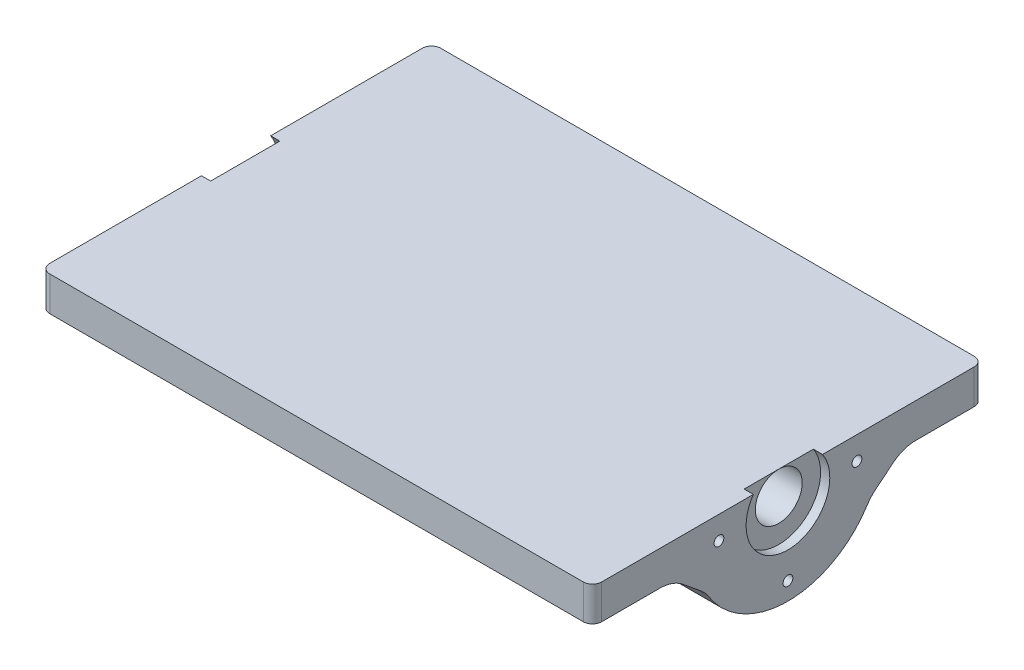
ISO-10303-21;
HEADER;
FILE_DESCRIPTION(('STEP AP214'),'2;1');
FILE_NAME('part.step','',(''),(''),'','','');
FILE_SCHEMA(('AUTOMOTIVE_DESIGN { 1 0 10303 214 1 1 1 1 }'));
ENDSEC;
DATA;
#1=APPLICATION_CONTEXT('core data for automotive mechanical design processes');
#2=APPLICATION_PROTOCOL_DEFINITION('international standard','automotive_design',2000,#1);
#3=PRODUCT_CONTEXT('',#1,'mechanical');
#4=PRODUCT('Part','Part','',(#3));
#5=PRODUCT_RELATED_PRODUCT_CATEGORY('part','',(#4));
#6=PRODUCT_DEFINITION_FORMATION('','',#4);
#7=PRODUCT_DEFINITION_CONTEXT('part definition',#1,'design');
#8=PRODUCT_DEFINITION('design','',#6,#7);
#9=PRODUCT_DEFINITION_SHAPE('','',#8);
#10=(LENGTH_UNIT() NAMED_UNIT(*) SI_UNIT(.MILLI.,.METRE.));
#11=(NAMED_UNIT(*) PLANE_ANGLE_UNIT() SI_UNIT($,.RADIAN.));
#12=(NAMED_UNIT(*) SI_UNIT($,.STERADIAN.) SOLID_ANGLE_UNIT());
#13=UNCERTAINTY_MEASURE_WITH_UNIT(LENGTH_MEASURE(1.E-05),#10,'distance_accuracy_value','');
#14=(GEOMETRIC_REPRESENTATION_CONTEXT(3) GLOBAL_UNCERTAINTY_ASSIGNED_CONTEXT((#13)) GLOBAL_UNIT_ASSIGNED_CONTEXT((#10,
#11,#12)) REPRESENTATION_CONTEXT('',''));
#15=CARTESIAN_POINT('',(0.,0.,0.));
#16=DIRECTION('',(0.,0.,1.));
#17=DIRECTION('',(1.,0.,0.));
#18=AXIS2_PLACEMENT_3D('',#15,#16,#17);
#19=CARTESIAN_POINT('',(-154.686,-6.50240000000002,53.975));
#20=DIRECTION('',(1.,0.,0.));
#21=DIRECTION('',(0.,1.,0.));
#22=AXIS2_PLACEMENT_3D('',#19,#20,#21);
#23=CYLINDRICAL_SURFACE('',#22,6.477);
#24=CARTESIAN_POINT('',(-2.53999999999999,-6.5024,53.975));
#25=DIRECTION('',(1.,0.,0.));
#26=DIRECTION('',(0.,1.,0.));
#27=AXIS2_PLACEMENT_3D('',#24,#25,#26);
#28=CIRCLE('',#27,6.477);
#29=CARTESIAN_POINT('',(-2.53999999999999,-0.0254000000000061,53.975));
#30=VERTEX_POINT('',#29);
#31=EDGE_CURVE('E325',#30,#30,#28,.F.);
#32=ORIENTED_EDGE('',*,*,#31,.F.);
#33=EDGE_LOOP('',(#32));
#34=FACE_BOUND('',#33,.T.);
#35=CARTESIAN_POINT('',(-149.86,-6.50240000000002,53.975));
#36=DIRECTION('',(-1.,0.,0.));
#37=DIRECTION('',(0.,0.,1.));
#38=AXIS2_PLACEMENT_3D('',#35,#36,#37);
#39=CIRCLE('',#38,6.477);
#40=CARTESIAN_POINT('',(-149.86,-6.50240000000002,60.452));
#41=VERTEX_POINT('',#40);
#42=EDGE_CURVE('E191',#41,#41,#39,.F.);
#43=ORIENTED_EDGE('',*,*,#42,.F.);
#44=EDGE_LOOP('',(#43));
#45=FACE_BOUND('',#44,.T.);
#46=ADVANCED_FACE('F44',(#34,#45),#23,.F.);
#47=CARTESIAN_POINT('',(0.,0.,107.95));
#48=DIRECTION('',(0.,-1.,0.));
#49=DIRECTION('',(1.,0.,0.));
#50=AXIS2_PLACEMENT_3D('',#47,#48,#49);
#51=PLANE('',#50);
#52=DIRECTION('',(-1.,0.,0.));
#53=VECTOR('',#52,1.);
#54=CARTESIAN_POINT('',(0.,0.,107.95));
#55=LINE('',#54,#53);
#56=CARTESIAN_POINT('',(-2.54,0.,107.95));
#57=VERTEX_POINT('',#56);
#58=CARTESIAN_POINT('',(-149.86,0.,107.95));
#59=VERTEX_POINT('',#58);
#60=EDGE_CURVE('E310',#57,#59,#55,.T.);
#61=ORIENTED_EDGE('',*,*,#60,.F.);
#62=CARTESIAN_POINT('',(-2.54,0.,105.41));
#63=DIRECTION('',(0.,-1.,0.));
#64=DIRECTION('',(1.,0.,0.));
#65=AXIS2_PLACEMENT_3D('',#62,#63,#64);
#66=CIRCLE('',#65,2.54);
#67=CARTESIAN_POINT('',(0.,0.,105.41));
#68=VERTEX_POINT('',#67);
#69=EDGE_CURVE('E270',#57,#68,#66,.F.);
#70=ORIENTED_EDGE('',*,*,#69,.T.);
#71=DIRECTION('',(0.,0.,-1.));
#72=VECTOR('',#71,1.);
#73=CARTESIAN_POINT('',(0.,0.,107.95));
#74=LINE('',#73,#72);
#75=CARTESIAN_POINT('',(0.,0.,63.5292159929531));
#76=VERTEX_POINT('',#75);
#77=EDGE_CURVE('E323',#68,#76,#74,.T.);
#78=ORIENTED_EDGE('',*,*,#77,.T.);
#79=DIRECTION('',(1.,0.,0.));
#80=VECTOR('',#79,1.);
#81=CARTESIAN_POINT('',(-2.54,0.,63.5292159929531));
#82=LINE('',#81,#80);
#83=CARTESIAN_POINT('',(-2.54,0.,63.5292159929531));
#84=VERTEX_POINT('',#83);
#85=EDGE_CURVE('E209',#76,#84,#82,.F.);
#86=ORIENTED_EDGE('',*,*,#85,.T.);
#87=DIRECTION('',(0.,0.,1.));
#88=VECTOR('',#87,1.);
#89=CARTESIAN_POINT('',(-2.54,0.,107.95));
#90=LINE('',#89,#88);
#91=CARTESIAN_POINT('',(-2.54,0.,44.4207840070469));
#92=VERTEX_POINT('',#91);
#93=EDGE_CURVE('E327',#92,#84,#90,.T.);
#94=ORIENTED_EDGE('',*,*,#93,.F.);
#95=DIRECTION('',(1.,0.,0.));
#96=VECTOR('',#95,1.);
#97=CARTESIAN_POINT('',(-2.54,0.,44.4207840070469));
#98=LINE('',#97,#96);
#99=CARTESIAN_POINT('',(0.,0.,44.4207840070469));
#100=VERTEX_POINT('',#99);
#101=EDGE_CURVE('E203',#92,#100,#98,.T.);
#102=ORIENTED_EDGE('',*,*,#101,.T.);
#103=CARTESIAN_POINT('',(0.,0.,2.54));
#104=VERTEX_POINT('',#103);
#105=EDGE_CURVE('E307',#100,#104,#74,.T.);
#106=ORIENTED_EDGE('',*,*,#105,.T.);
#107=CARTESIAN_POINT('',(-2.54,0.,2.54));
#108=DIRECTION('',(0.,-1.,0.));
#109=DIRECTION('',(1.,0.,0.));
#110=AXIS2_PLACEMENT_3D('',#107,#108,#109);
#111=CIRCLE('',#110,2.54);
#112=CARTESIAN_POINT('',(-2.54,0.,0.));
#113=VERTEX_POINT('',#112);
#114=EDGE_CURVE('E264',#104,#113,#111,.F.);
#115=ORIENTED_EDGE('',*,*,#114,.T.);
#116=DIRECTION('',(-1.,0.,0.));
#117=VECTOR('',#116,1.);
#118=CARTESIAN_POINT('',(0.,0.,0.));
#119=LINE('',#118,#117);
#120=CARTESIAN_POINT('',(-149.86,0.,0.));
#121=VERTEX_POINT('',#120);
#122=EDGE_CURVE('E305',#113,#121,#119,.T.);
#123=ORIENTED_EDGE('',*,*,#122,.T.);
#124=CARTESIAN_POINT('',(-149.86,0.,2.54));
#125=DIRECTION('',(0.,-1.,0.));
#126=DIRECTION('',(1.,0.,0.));
#127=AXIS2_PLACEMENT_3D('',#124,#125,#126);
#128=CIRCLE('',#127,2.54);
#129=CARTESIAN_POINT('',(-152.4,0.,2.54));
#130=VERTEX_POINT('',#129);
#131=EDGE_CURVE('E266',#121,#130,#128,.F.);
#132=ORIENTED_EDGE('',*,*,#131,.T.);
#133=DIRECTION('',(0.,0.,-1.));
#134=VECTOR('',#133,1.);
#135=CARTESIAN_POINT('',(-152.4,0.,107.95));
#136=LINE('',#135,#134);
#137=CARTESIAN_POINT('',(-152.4,0.,44.4207840070469));
#138=VERTEX_POINT('',#137);
#139=EDGE_CURVE('E314',#138,#130,#136,.T.);
#140=ORIENTED_EDGE('',*,*,#139,.F.);
#141=DIRECTION('',(-1.,0.,0.));
#142=VECTOR('',#141,1.);
#143=CARTESIAN_POINT('',(-149.86,0.,44.4207840070469));
#144=LINE('',#143,#142);
#145=CARTESIAN_POINT('',(-149.86,0.,44.4207840070469));
#146=VERTEX_POINT('',#145);
#147=EDGE_CURVE('E192',#146,#138,#144,.T.);
#148=ORIENTED_EDGE('',*,*,#147,.F.);
#149=DIRECTION('',(0.,0.,-1.));
#150=VECTOR('',#149,1.);
#151=CARTESIAN_POINT('',(-149.86,0.,107.95));
#152=LINE('',#151,#150);
#153=CARTESIAN_POINT('',(-149.86,0.,63.5292159929531));
#154=VERTEX_POINT('',#153);
#155=EDGE_CURVE('E197',#154,#146,#152,.T.);
#156=ORIENTED_EDGE('',*,*,#155,.F.);
#157=DIRECTION('',(-1.,0.,0.));
#158=VECTOR('',#157,1.);
#159=CARTESIAN_POINT('',(-149.86,0.,63.5292159929531));
#160=LINE('',#159,#158);
#161=CARTESIAN_POINT('',(-152.4,0.,63.5292159929531));
#162=VERTEX_POINT('',#161);
#163=EDGE_CURVE('E181',#162,#154,#160,.F.);
#164=ORIENTED_EDGE('',*,*,#163,.F.);
#165=CARTESIAN_POINT('',(-152.4,0.,105.41));
#166=VERTEX_POINT('',#165);
#167=EDGE_CURVE('E321',#166,#162,#136,.T.);
#168=ORIENTED_EDGE('',*,*,#167,.F.);
#169=CARTESIAN_POINT('',(-149.86,0.,105.41));
#170=DIRECTION('',(0.,-1.,0.));
#171=DIRECTION('',(1.,0.,0.));
#172=AXIS2_PLACEMENT_3D('',#169,#170,#171);
#173=CIRCLE('',#172,2.54);
#174=EDGE_CURVE('E268',#166,#59,#173,.F.);
#175=ORIENTED_EDGE('',*,*,#174,.T.);
#176=EDGE_LOOP('',(#61,#70,#78,#86,#94,#102,#106,#115,#123,#132,#140,#148,#156,#164,#168,#175));
#177=FACE_BOUND('',#176,.T.);
#178=ADVANCED_FACE('F200',(#177),#51,.F.);
#179=CARTESIAN_POINT('',(0.,0.,107.95));
#180=DIRECTION('',(-1.,0.,0.));
#181=DIRECTION('',(0.,-1.,0.));
#182=AXIS2_PLACEMENT_3D('',#179,#180,#181);
#183=PLANE('',#182);
#184=CARTESIAN_POINT('',(0.,-6.35,73.025));
#185=DIRECTION('',(1.,0.,0.));
#186=DIRECTION('',(0.,1.,0.));
#187=AXIS2_PLACEMENT_3D('',#184,#185,#186);
#188=CIRCLE('',#187,1.35255);
#189=CARTESIAN_POINT('',(0.,-4.99745,73.025));
#190=VERTEX_POINT('',#189);
#191=EDGE_CURVE('E317',#190,#190,#188,.T.);
#192=ORIENTED_EDGE('',*,*,#191,.F.);
#193=EDGE_LOOP('',(#192));
#194=FACE_BOUND('',#193,.T.);
#195=CARTESIAN_POINT('',(0.,-6.35,34.925));
#196=DIRECTION('',(1.,0.,0.));
#197=DIRECTION('',(0.,1.,0.));
#198=AXIS2_PLACEMENT_3D('',#195,#196,#197);
#199=CIRCLE('',#198,1.35255);
#200=CARTESIAN_POINT('',(0.,-4.99745,34.925));
#201=VERTEX_POINT('',#200);
#202=EDGE_CURVE('E348',#201,#201,#199,.T.);
#203=ORIENTED_EDGE('',*,*,#202,.F.);
#204=EDGE_LOOP('',(#203));
#205=FACE_BOUND('',#204,.T.);
#206=CARTESIAN_POINT('',(0.,-25.4,53.975));
#207=DIRECTION('',(1.,0.,0.));
#208=DIRECTION('',(0.,1.,0.));
#209=AXIS2_PLACEMENT_3D('',#206,#207,#208);
#210=CIRCLE('',#209,1.35255);
#211=CARTESIAN_POINT('',(0.,-24.04745,53.975));
#212=VERTEX_POINT('',#211);
#213=EDGE_CURVE('E354',#212,#212,#210,.T.);
#214=ORIENTED_EDGE('',*,*,#213,.F.);
#215=EDGE_LOOP('',(#214));
#216=FACE_BOUND('',#215,.T.);
#217=ORIENTED_EDGE('',*,*,#77,.F.);
#218=DIRECTION('',(0.,1.,0.));
#219=VECTOR('',#218,1.);
#220=CARTESIAN_POINT('',(0.,0.,105.41));
#221=LINE('',#220,#219);
#222=CARTESIAN_POINT('',(0.,-9.525,105.41));
#223=VERTEX_POINT('',#222);
#224=EDGE_CURVE('E275',#68,#223,#221,.F.);
#225=ORIENTED_EDGE('',*,*,#224,.T.);
#226=DIRECTION('',(0.,0.,1.));
#227=VECTOR('',#226,1.);
#228=CARTESIAN_POINT('',(0.,-9.525,107.95));
#229=LINE('',#228,#227);
#230=CARTESIAN_POINT('',(0.,-9.525,89.2974040542828));
#231=VERTEX_POINT('',#230);
#232=EDGE_CURVE('E466',#231,#223,#229,.T.);
#233=ORIENTED_EDGE('',*,*,#232,.F.);
#234=CARTESIAN_POINT('',(0.,-19.525,89.2974040542828));
#235=DIRECTION('',(-1.,0.,0.));
#236=DIRECTION('',(0.,-1.,0.));
#237=AXIS2_PLACEMENT_3D('',#234,#235,#236);
#238=CIRCLE('',#237,10.);
#239=CARTESIAN_POINT('',(0.,-11.7885396183789,82.9612237566897));
#240=VERTEX_POINT('',#239);
#241=EDGE_CURVE('E241',#231,#240,#238,.T.);
#242=ORIENTED_EDGE('',*,*,#241,.T.);
#243=DIRECTION('',(0.,-0.633618029759309,-0.773646038162112));
#244=VECTOR('',#243,1.);
#245=CARTESIAN_POINT('',(0.,5.19362681087083,103.696406722347));
#246=LINE('',#245,#244);
#247=CARTESIAN_POINT('',(0.,-15.8476535429056,78.0050557522034));
#248=VERTEX_POINT('',#247);
#249=EDGE_CURVE('E202',#240,#248,#246,.T.);
#250=ORIENTED_EDGE('',*,*,#249,.T.);
#251=CARTESIAN_POINT('',(0.,-23.5841139245267,84.3412360497965));
#252=DIRECTION('',(-1.,0.,0.));
#253=DIRECTION('',(0.,-1.,0.));
#254=AXIS2_PLACEMENT_3D('',#251,#252,#253);
#255=CIRCLE('',#254,10.);
#256=CARTESIAN_POINT('',(0.,-18.2470161357175,75.8845589723217));
#257=VERTEX_POINT('',#256);
#258=EDGE_CURVE('E247',#248,#257,#255,.T.);
#259=ORIENTED_EDGE('',*,*,#258,.T.);
#260=CARTESIAN_POINT('',(0.,-4.41966318447054,53.975));
#261=DIRECTION('',(-1.,0.,0.));
#262=DIRECTION('',(0.,1.,0.));
#263=AXIS2_PLACEMENT_3D('',#260,#261,#262);
#264=CIRCLE('',#263,25.908);
#265=CARTESIAN_POINT('',(0.,-18.2470161357175,32.0654410276783));
#266=VERTEX_POINT('',#265);
#267=EDGE_CURVE('E302',#266,#257,#264,.T.);
#268=ORIENTED_EDGE('',*,*,#267,.F.);
#269=CARTESIAN_POINT('',(0.,-23.5841139245268,23.6087639502035));
#270=DIRECTION('',(-1.,0.,0.));
#271=DIRECTION('',(0.,-1.,0.));
#272=AXIS2_PLACEMENT_3D('',#269,#270,#271);
#273=CIRCLE('',#272,10.);
#274=CARTESIAN_POINT('',(0.,-15.8476535429057,29.9449442477966));
#275=VERTEX_POINT('',#274);
#276=EDGE_CURVE('E249',#266,#275,#273,.T.);
#277=ORIENTED_EDGE('',*,*,#276,.T.);
#278=DIRECTION('',(0.,0.633618029759308,-0.773646038162112));
#279=VECTOR('',#278,1.);
#280=CARTESIAN_POINT('',(0.,-47.7230398557958,68.8647116433393));
#281=LINE('',#280,#279);
#282=CARTESIAN_POINT('',(0.,-11.7885396183789,24.9887762433102));
#283=VERTEX_POINT('',#282);
#284=EDGE_CURVE('E215',#275,#283,#281,.T.);
#285=ORIENTED_EDGE('',*,*,#284,.T.);
#286=CARTESIAN_POINT('',(0.,-19.525,18.6525959457171));
#287=DIRECTION('',(-1.,0.,0.));
#288=DIRECTION('',(0.,-1.,0.));
#289=AXIS2_PLACEMENT_3D('',#286,#287,#288);
#290=CIRCLE('',#289,10.);
#291=CARTESIAN_POINT('',(0.,-9.525,18.6525959457171));
#292=VERTEX_POINT('',#291);
#293=EDGE_CURVE('E255',#283,#292,#290,.T.);
#294=ORIENTED_EDGE('',*,*,#293,.T.);
#295=DIRECTION('',(0.,0.,1.));
#296=VECTOR('',#295,1.);
#297=CARTESIAN_POINT('',(0.,-9.525,28.575));
#298=LINE('',#297,#296);
#299=CARTESIAN_POINT('',(0.,-9.525,2.54));
#300=VERTEX_POINT('',#299);
#301=EDGE_CURVE('E291',#300,#292,#298,.T.);
#302=ORIENTED_EDGE('',*,*,#301,.F.);
#303=DIRECTION('',(0.,1.,0.));
#304=VECTOR('',#303,1.);
#305=CARTESIAN_POINT('',(0.,0.,2.54));
#306=LINE('',#305,#304);
#307=EDGE_CURVE('E272',#300,#104,#306,.T.);
#308=ORIENTED_EDGE('',*,*,#307,.T.);
#309=ORIENTED_EDGE('',*,*,#105,.F.);
#310=CARTESIAN_POINT('',(0.,-6.5024,53.975));
#311=DIRECTION('',(1.,0.,0.));
#312=DIRECTION('',(0.,1.,0.));
#313=AXIS2_PLACEMENT_3D('',#310,#311,#312);
#314=CIRCLE('',#313,11.557);
#315=EDGE_CURVE('E337',#76,#100,#314,.T.);
#316=ORIENTED_EDGE('',*,*,#315,.F.);
#317=EDGE_LOOP('',(#217,#225,#233,#242,#250,#259,#268,#277,#285,#294,#302,#308,#309,#316));
#318=FACE_BOUND('',#317,.T.);
#319=ADVANCED_FACE('F297',(#194,#205,#216,#318),#183,.F.);
#320=CARTESIAN_POINT('',(-152.4,0.,107.95));
#321=DIRECTION('',(1.,0.,0.));
#322=DIRECTION('',(0.,0.,-1.));
#323=AXIS2_PLACEMENT_3D('',#320,#321,#322);
#324=PLANE('',#323);
#325=DIRECTION('',(0.,0.,1.));
#326=VECTOR('',#325,1.);
#327=CARTESIAN_POINT('',(-152.4,-9.52500000000002,107.95));
#328=LINE('',#327,#326);
#329=CARTESIAN_POINT('',(-152.4,-9.52500000000002,89.2974040542828));
#330=VERTEX_POINT('',#329);
#331=CARTESIAN_POINT('',(-152.4,-9.52500000000002,105.41));
#332=VERTEX_POINT('',#331);
#333=EDGE_CURVE('E464',#330,#332,#328,.T.);
#334=ORIENTED_EDGE('',*,*,#333,.T.);
#335=DIRECTION('',(0.,-1.,0.));
#336=VECTOR('',#335,1.);
#337=CARTESIAN_POINT('',(-152.4,0.,105.41));
#338=LINE('',#337,#336);
#339=EDGE_CURVE('E284',#332,#166,#338,.F.);
#340=ORIENTED_EDGE('',*,*,#339,.T.);
#341=ORIENTED_EDGE('',*,*,#167,.T.);
#342=CARTESIAN_POINT('',(-152.4,-6.50240000000001,53.975));
#343=DIRECTION('',(1.,0.,0.));
#344=DIRECTION('',(0.,1.,0.));
#345=AXIS2_PLACEMENT_3D('',#342,#343,#344);
#346=CIRCLE('',#345,11.557);
#347=EDGE_CURVE('E187',#162,#138,#346,.T.);
#348=ORIENTED_EDGE('',*,*,#347,.T.);
#349=ORIENTED_EDGE('',*,*,#139,.T.);
#350=DIRECTION('',(0.,-1.,0.));
#351=VECTOR('',#350,1.);
#352=CARTESIAN_POINT('',(-152.4,-9.52500000000001,2.54));
#353=LINE('',#352,#351);
#354=CARTESIAN_POINT('',(-152.4,-9.52500000000002,2.54));
#355=VERTEX_POINT('',#354);
#356=EDGE_CURVE('E281',#130,#355,#353,.T.);
#357=ORIENTED_EDGE('',*,*,#356,.T.);
#358=DIRECTION('',(0.,0.,1.));
#359=VECTOR('',#358,1.);
#360=CARTESIAN_POINT('',(-152.4,-9.52500000000002,28.575));
#361=LINE('',#360,#359);
#362=CARTESIAN_POINT('',(-152.4,-9.52500000000002,18.6525959457171));
#363=VERTEX_POINT('',#362);
#364=EDGE_CURVE('E469',#355,#363,#361,.T.);
#365=ORIENTED_EDGE('',*,*,#364,.T.);
#366=CARTESIAN_POINT('',(-152.4,-19.525,18.6525959457171));
#367=DIRECTION('',(1.,0.,0.));
#368=DIRECTION('',(0.,0.,-1.));
#369=AXIS2_PLACEMENT_3D('',#366,#367,#368);
#370=CIRCLE('',#369,10.);
#371=CARTESIAN_POINT('',(-152.4,-11.7885396183789,24.9887762433102));
#372=VERTEX_POINT('',#371);
#373=EDGE_CURVE('E253',#363,#372,#370,.T.);
#374=ORIENTED_EDGE('',*,*,#373,.T.);
#375=DIRECTION('',(0.,-0.633618029759308,0.773646038162112));
#376=VECTOR('',#375,1.);
#377=CARTESIAN_POINT('',(-152.4,-47.7230398557959,68.8647116433393));
#378=LINE('',#377,#376);
#379=CARTESIAN_POINT('',(-152.4,-15.8476535429057,29.9449442477966));
#380=VERTEX_POINT('',#379);
#381=EDGE_CURVE('E218',#372,#380,#378,.T.);
#382=ORIENTED_EDGE('',*,*,#381,.T.);
#383=CARTESIAN_POINT('',(-152.4,-23.5841139245268,23.6087639502035));
#384=DIRECTION('',(1.,0.,0.));
#385=DIRECTION('',(0.,0.,-1.));
#386=AXIS2_PLACEMENT_3D('',#383,#384,#385);
#387=CIRCLE('',#386,10.);
#388=CARTESIAN_POINT('',(-152.4,-18.2470161357176,32.0654410276783));
#389=VERTEX_POINT('',#388);
#390=EDGE_CURVE('E251',#380,#389,#387,.T.);
#391=ORIENTED_EDGE('',*,*,#390,.T.);
#392=CARTESIAN_POINT('',(-152.4,-4.41966318447056,53.975));
#393=DIRECTION('',(-1.,0.,0.));
#394=DIRECTION('',(0.,1.,0.));
#395=AXIS2_PLACEMENT_3D('',#392,#393,#394);
#396=CIRCLE('',#395,25.908);
#397=CARTESIAN_POINT('',(-152.4,-18.2470161357175,75.8845589723217));
#398=VERTEX_POINT('',#397);
#399=EDGE_CURVE('E473',#389,#398,#396,.T.);
#400=ORIENTED_EDGE('',*,*,#399,.T.);
#401=CARTESIAN_POINT('',(-152.4,-23.5841139245267,84.3412360497965));
#402=DIRECTION('',(1.,0.,0.));
#403=DIRECTION('',(0.,0.,-1.));
#404=AXIS2_PLACEMENT_3D('',#401,#402,#403);
#405=CIRCLE('',#404,10.);
#406=CARTESIAN_POINT('',(-152.4,-15.8476535429056,78.0050557522034));
#407=VERTEX_POINT('',#406);
#408=EDGE_CURVE('E245',#398,#407,#405,.T.);
#409=ORIENTED_EDGE('',*,*,#408,.T.);
#410=DIRECTION('',(0.,0.633618029759309,0.773646038162112));
#411=VECTOR('',#410,1.);
#412=CARTESIAN_POINT('',(-152.4,5.19362681087081,103.696406722347));
#413=LINE('',#412,#411);
#414=CARTESIAN_POINT('',(-152.4,-11.7885396183789,82.9612237566897));
#415=VERTEX_POINT('',#414);
#416=EDGE_CURVE('E206',#407,#415,#413,.T.);
#417=ORIENTED_EDGE('',*,*,#416,.T.);
#418=CARTESIAN_POINT('',(-152.4,-19.525,89.2974040542828));
#419=DIRECTION('',(1.,0.,0.));
#420=DIRECTION('',(0.,0.,-1.));
#421=AXIS2_PLACEMENT_3D('',#418,#419,#420);
#422=CIRCLE('',#421,10.);
#423=EDGE_CURVE('E243',#415,#330,#422,.T.);
#424=ORIENTED_EDGE('',*,*,#423,.T.);
#425=EDGE_LOOP('',(#334,#340,#341,#348,#349,#357,#365,#374,#382,#391,#400,#409,#417,#424));
#426=FACE_BOUND('',#425,.T.);
#427=CARTESIAN_POINT('',(-152.4,-6.35000000000002,73.025));
#428=DIRECTION('',(1.,0.,0.));
#429=DIRECTION('',(0.,1.,0.));
#430=AXIS2_PLACEMENT_3D('',#427,#428,#429);
#431=CIRCLE('',#430,1.35255);
#432=CARTESIAN_POINT('',(-152.4,-4.99745000000002,73.025));
#433=VERTEX_POINT('',#432);
#434=EDGE_CURVE('E311',#433,#433,#431,.T.);
#435=ORIENTED_EDGE('',*,*,#434,.T.);
#436=EDGE_LOOP('',(#435));
#437=FACE_BOUND('',#436,.T.);
#438=CARTESIAN_POINT('',(-152.4,-6.35000000000002,34.925));
#439=DIRECTION('',(1.,0.,0.));
#440=DIRECTION('',(0.,1.,0.));
#441=AXIS2_PLACEMENT_3D('',#438,#439,#440);
#442=CIRCLE('',#441,1.35255);
#443=CARTESIAN_POINT('',(-152.4,-4.99745000000002,34.925));
#444=VERTEX_POINT('',#443);
#445=EDGE_CURVE('E351',#444,#444,#442,.T.);
#446=ORIENTED_EDGE('',*,*,#445,.T.);
#447=EDGE_LOOP('',(#446));
#448=FACE_BOUND('',#447,.T.);
#449=CARTESIAN_POINT('',(-152.4,-25.4,53.975));
#450=DIRECTION('',(1.,0.,0.));
#451=DIRECTION('',(0.,1.,0.));
#452=AXIS2_PLACEMENT_3D('',#449,#450,#451);
#453=CIRCLE('',#452,1.35255);
#454=CARTESIAN_POINT('',(-152.4,-24.04745,53.975));
#455=VERTEX_POINT('',#454);
#456=EDGE_CURVE('E344',#455,#455,#453,.T.);
#457=ORIENTED_EDGE('',*,*,#456,.T.);
#458=EDGE_LOOP('',(#457));
#459=FACE_BOUND('',#458,.T.);
#460=ADVANCED_FACE('F359',(#426,#437,#448,#459),#324,.F.);
#461=CARTESIAN_POINT('',(0.,0.,107.95));
#462=DIRECTION('',(0.,0.,-1.));
#463=DIRECTION('',(-1.,0.,0.));
#464=AXIS2_PLACEMENT_3D('',#461,#462,#463);
#465=PLANE('',#464);
#466=DIRECTION('',(1.,0.,0.));
#467=VECTOR('',#466,1.);
#468=CARTESIAN_POINT('',(-152.4,-9.52500000000002,107.95));
#469=LINE('',#468,#467);
#470=CARTESIAN_POINT('',(-149.86,-9.52500000000002,107.95));
#471=VERTEX_POINT('',#470);
#472=CARTESIAN_POINT('',(-2.54000000000004,-9.525,107.95));
#473=VERTEX_POINT('',#472);
#474=EDGE_CURVE('E458',#471,#473,#469,.T.);
#475=ORIENTED_EDGE('',*,*,#474,.T.);
#476=DIRECTION('',(0.,1.,0.));
#477=VECTOR('',#476,1.);
#478=CARTESIAN_POINT('',(-2.54,0.,107.95));
#479=LINE('',#478,#477);
#480=EDGE_CURVE('E261',#473,#57,#479,.T.);
#481=ORIENTED_EDGE('',*,*,#480,.T.);
#482=ORIENTED_EDGE('',*,*,#60,.T.);
#483=DIRECTION('',(0.,-1.,0.));
#484=VECTOR('',#483,1.);
#485=CARTESIAN_POINT('',(-149.86,0.,107.95));
#486=LINE('',#485,#484);
#487=EDGE_CURVE('E258',#59,#471,#486,.T.);
#488=ORIENTED_EDGE('',*,*,#487,.T.);
#489=EDGE_LOOP('',(#475,#481,#482,#488));
#490=FACE_BOUND('',#489,.T.);
#491=ADVANCED_FACE('F373',(#490),#465,.F.);
#492=CARTESIAN_POINT('',(0.,0.,0.));
#493=DIRECTION('',(0.,0.,-1.));
#494=DIRECTION('',(-1.,0.,0.));
#495=AXIS2_PLACEMENT_3D('',#492,#493,#494);
#496=PLANE('',#495);
#497=DIRECTION('',(1.,0.,0.));
#498=VECTOR('',#497,1.);
#499=CARTESIAN_POINT('',(-152.4,-9.52500000000002,0.));
#500=LINE('',#499,#498);
#501=CARTESIAN_POINT('',(-149.86,-9.52500000000002,0.));
#502=VERTEX_POINT('',#501);
#503=CARTESIAN_POINT('',(-2.54000000000004,-9.525,0.));
#504=VERTEX_POINT('',#503);
#505=EDGE_CURVE('E292',#502,#504,#500,.T.);
#506=ORIENTED_EDGE('',*,*,#505,.F.);
#507=DIRECTION('',(0.,-1.,0.));
#508=VECTOR('',#507,1.);
#509=CARTESIAN_POINT('',(-149.86,0.,0.));
#510=LINE('',#509,#508);
#511=EDGE_CURVE('E12',#502,#121,#510,.F.);
#512=ORIENTED_EDGE('',*,*,#511,.T.);
#513=ORIENTED_EDGE('',*,*,#122,.F.);
#514=DIRECTION('',(0.,1.,0.));
#515=VECTOR('',#514,1.);
#516=CARTESIAN_POINT('',(-2.54,-9.525,0.));
#517=LINE('',#516,#515);
#518=EDGE_CURVE('E52',#113,#504,#517,.F.);
#519=ORIENTED_EDGE('',*,*,#518,.T.);
#520=EDGE_LOOP('',(#506,#512,#513,#519));
#521=FACE_BOUND('',#520,.T.);
#522=ADVANCED_FACE('F308',(#521),#496,.T.);
#523=CARTESIAN_POINT('',(-152.4,-25.4,53.975));
#524=DIRECTION('',(1.,0.,0.));
#525=DIRECTION('',(0.,1.,0.));
#526=AXIS2_PLACEMENT_3D('',#523,#524,#525);
#527=CYLINDRICAL_SURFACE('',#526,1.35255);
#528=CARTESIAN_POINT('',(0.,-24.04745,53.975));
#529=CARTESIAN_POINT('',(-1.5875,-24.04745,53.975));
#530=CARTESIAN_POINT('',(-3.175,-24.04745,53.975));
#531=CARTESIAN_POINT('',(-6.35,-24.04745,53.975));
#532=CARTESIAN_POINT('',(-7.93750000000001,-24.04745,53.975));
#533=CARTESIAN_POINT('',(-11.1125,-24.04745,53.975));
#534=CARTESIAN_POINT('',(-12.7,-24.04745,53.975));
#535=CARTESIAN_POINT('',(-15.875,-24.04745,53.975));
#536=CARTESIAN_POINT('',(-17.4625,-24.04745,53.975));
#537=CARTESIAN_POINT('',(-20.6375,-24.04745,53.975));
#538=CARTESIAN_POINT('',(-22.225,-24.04745,53.975));
#539=CARTESIAN_POINT('',(-25.4,-24.04745,53.975));
#540=CARTESIAN_POINT('',(-26.9875,-24.04745,53.975));
#541=CARTESIAN_POINT('',(-30.1625,-24.04745,53.975));
#542=CARTESIAN_POINT('',(-31.75,-24.04745,53.975));
#543=CARTESIAN_POINT('',(-34.925,-24.04745,53.975));
#544=CARTESIAN_POINT('',(-36.5125,-24.04745,53.975));
#545=CARTESIAN_POINT('',(-39.6875,-24.04745,53.975));
#546=CARTESIAN_POINT('',(-41.275,-24.04745,53.975));
#547=CARTESIAN_POINT('',(-44.45,-24.04745,53.975));
#548=CARTESIAN_POINT('',(-46.0375,-24.04745,53.975));
#549=CARTESIAN_POINT('',(-49.2125,-24.04745,53.975));
#550=CARTESIAN_POINT('',(-50.8,-24.04745,53.975));
#551=CARTESIAN_POINT('',(-53.975,-24.04745,53.975));
#552=CARTESIAN_POINT('',(-55.5625,-24.04745,53.975));
#553=CARTESIAN_POINT('',(-58.7375,-24.04745,53.975));
#554=CARTESIAN_POINT('',(-60.325,-24.04745,53.975));
#555=CARTESIAN_POINT('',(-63.5,-24.04745,53.975));
#556=CARTESIAN_POINT('',(-65.0875,-24.04745,53.975));
#557=CARTESIAN_POINT('',(-68.2625,-24.04745,53.975));
#558=CARTESIAN_POINT('',(-69.85,-24.04745,53.975));
#559=CARTESIAN_POINT('',(-73.025,-24.04745,53.975));
#560=CARTESIAN_POINT('',(-74.6125,-24.04745,53.975));
#561=CARTESIAN_POINT('',(-77.7875,-24.04745,53.975));
#562=CARTESIAN_POINT('',(-79.375,-24.04745,53.975));
#563=CARTESIAN_POINT('',(-82.55,-24.04745,53.975));
#564=CARTESIAN_POINT('',(-84.1375,-24.04745,53.975));
#565=CARTESIAN_POINT('',(-87.3125,-24.04745,53.975));
#566=CARTESIAN_POINT('',(-88.9,-24.04745,53.975));
#567=CARTESIAN_POINT('',(-92.075,-24.04745,53.975));
#568=CARTESIAN_POINT('',(-93.6625,-24.04745,53.975));
#569=CARTESIAN_POINT('',(-96.8375,-24.04745,53.975));
#570=CARTESIAN_POINT('',(-98.425,-24.04745,53.975));
#571=CARTESIAN_POINT('',(-101.6,-24.04745,53.975));
#572=CARTESIAN_POINT('',(-103.1875,-24.04745,53.975));
#573=CARTESIAN_POINT('',(-106.3625,-24.04745,53.975));
#574=CARTESIAN_POINT('',(-107.95,-24.04745,53.975));
#575=CARTESIAN_POINT('',(-111.125,-24.04745,53.975));
#576=CARTESIAN_POINT('',(-112.7125,-24.04745,53.975));
#577=CARTESIAN_POINT('',(-115.8875,-24.04745,53.975));
#578=CARTESIAN_POINT('',(-117.475,-24.04745,53.975));
#579=CARTESIAN_POINT('',(-120.65,-24.04745,53.975));
#580=CARTESIAN_POINT('',(-122.2375,-24.04745,53.975));
#581=CARTESIAN_POINT('',(-125.4125,-24.04745,53.975));
#582=CARTESIAN_POINT('',(-127.,-24.04745,53.975));
#583=CARTESIAN_POINT('',(-130.175,-24.04745,53.975));
#584=CARTESIAN_POINT('',(-131.7625,-24.04745,53.975));
#585=CARTESIAN_POINT('',(-134.9375,-24.04745,53.975));
#586=CARTESIAN_POINT('',(-136.525,-24.04745,53.975));
#587=CARTESIAN_POINT('',(-139.7,-24.04745,53.975));
#588=CARTESIAN_POINT('',(-141.2875,-24.04745,53.975));
#589=CARTESIAN_POINT('',(-144.4625,-24.04745,53.975));
#590=CARTESIAN_POINT('',(-146.05,-24.04745,53.975));
#591=CARTESIAN_POINT('',(-149.225,-24.04745,53.975));
#592=CARTESIAN_POINT('',(-150.8125,-24.04745,53.975));
#593=CARTESIAN_POINT('',(-152.4,-24.04745,53.975));
#594=B_SPLINE_CURVE_WITH_KNOTS('',3,(#528,#529,#530,#531,#532,#533,#534,#535,#536,#537,#538,
#539,#540,#541,#542,#543,#544,#545,#546,#547,#548,#549,#550,#551,#552,#553,#554,#555,#556,#557,
#558,#559,#560,#561,#562,#563,#564,#565,#566,#567,#568,#569,#570,#571,#572,#573,#574,#575,#576,
#577,#578,#579,#580,#581,#582,#583,#584,#585,#586,#587,#588,#589,#590,#591,#592,#593),
.UNSPECIFIED.,.F.,.F.,(4,2,2,2,2,2,2,2,2,2,2,2,2,2,2,2,2,2,2,2,2,2,2,2,2,2,2,2,2,2,2,2,4),(0.,
4.7625,9.52500000000001,14.2875,19.05,23.8125,28.575,33.3375,38.1,42.8625,47.625,52.3875,57.15,
61.9125,66.675,71.4375,76.2,80.9625,85.725,90.4875,95.25,100.0125,104.775,109.5375,114.3,
119.0625,123.825,128.5875,133.35,138.1125,142.875,147.6375,152.4),.UNSPECIFIED.);
#595=EDGE_CURVE('BSEAM361',#212,#455,#594,.T.);
#596=ORIENTED_EDGE('',*,*,#213,.T.);
#597=ORIENTED_EDGE('',*,*,#456,.F.);
#598=ORIENTED_EDGE('',*,*,#595,.T.);
#599=ORIENTED_EDGE('',*,*,#595,.F.);
#600=EDGE_LOOP('',(#596,#598,#597,#599));
#601=FACE_BOUND('',#600,.T.);
#602=ADVANCED_FACE('F361',(#601),#527,.F.);
#603=CARTESIAN_POINT('',(-152.4,-6.35000000000002,34.925));
#604=DIRECTION('',(1.,0.,0.));
#605=DIRECTION('',(0.,1.,0.));
#606=AXIS2_PLACEMENT_3D('',#603,#604,#605);
#607=CYLINDRICAL_SURFACE('',#606,1.35255);
#608=CARTESIAN_POINT('',(-152.4,-4.99745000000002,34.925));
#609=CARTESIAN_POINT('',(-150.8125,-4.99745000000001,34.925));
#610=CARTESIAN_POINT('',(-149.225,-4.99745000000001,34.925));
#611=CARTESIAN_POINT('',(-146.05,-4.99745000000001,34.925));
#612=CARTESIAN_POINT('',(-144.4625,-4.99745000000001,34.925));
#613=CARTESIAN_POINT('',(-141.2875,-4.99745000000001,34.925));
#614=CARTESIAN_POINT('',(-139.7,-4.99745000000001,34.925));
#615=CARTESIAN_POINT('',(-136.525,-4.99745000000001,34.925));
#616=CARTESIAN_POINT('',(-134.9375,-4.99745000000001,34.925));
#617=CARTESIAN_POINT('',(-131.7625,-4.99745000000001,34.925));
#618=CARTESIAN_POINT('',(-130.175,-4.99745000000001,34.925));
#619=CARTESIAN_POINT('',(-127.,-4.99745000000001,34.925));
#620=CARTESIAN_POINT('',(-125.4125,-4.99745000000001,34.925));
#621=CARTESIAN_POINT('',(-122.2375,-4.99745000000001,34.925));
#622=CARTESIAN_POINT('',(-120.65,-4.99745000000001,34.925));
#623=CARTESIAN_POINT('',(-117.475,-4.99745000000001,34.925));
#624=CARTESIAN_POINT('',(-115.8875,-4.99745000000001,34.925));
#625=CARTESIAN_POINT('',(-112.7125,-4.99745000000001,34.925));
#626=CARTESIAN_POINT('',(-111.125,-4.99745000000001,34.925));
#627=CARTESIAN_POINT('',(-107.95,-4.99745000000001,34.925));
#628=CARTESIAN_POINT('',(-106.3625,-4.99745000000001,34.925));
#629=CARTESIAN_POINT('',(-103.1875,-4.99745000000001,34.925));
#630=CARTESIAN_POINT('',(-101.6,-4.99745000000001,34.925));
#631=CARTESIAN_POINT('',(-98.425,-4.99745000000001,34.925));
#632=CARTESIAN_POINT('',(-96.8375,-4.99745000000001,34.925));
#633=CARTESIAN_POINT('',(-93.6625,-4.99745000000001,34.925));
#634=CARTESIAN_POINT('',(-92.075,-4.99745000000001,34.925));
#635=CARTESIAN_POINT('',(-88.9,-4.99745000000001,34.925));
#636=CARTESIAN_POINT('',(-87.3125,-4.99745000000001,34.925));
#637=CARTESIAN_POINT('',(-84.1375,-4.99745000000001,34.925));
#638=CARTESIAN_POINT('',(-82.55,-4.99745000000001,34.925));
#639=CARTESIAN_POINT('',(-79.375,-4.99745000000001,34.925));
#640=CARTESIAN_POINT('',(-77.7875,-4.99745000000001,34.925));
#641=CARTESIAN_POINT('',(-74.6125,-4.99745000000001,34.925));
#642=CARTESIAN_POINT('',(-73.025,-4.99745000000001,34.925));
#643=CARTESIAN_POINT('',(-69.85,-4.99745000000001,34.925));
#644=CARTESIAN_POINT('',(-68.2625,-4.99745000000001,34.925));
#645=CARTESIAN_POINT('',(-65.0875,-4.99745000000001,34.925));
#646=CARTESIAN_POINT('',(-63.5,-4.99745000000001,34.925));
#647=CARTESIAN_POINT('',(-60.325,-4.99745000000001,34.925));
#648=CARTESIAN_POINT('',(-58.7375,-4.99745000000001,34.925));
#649=CARTESIAN_POINT('',(-55.5625,-4.99745000000001,34.925));
#650=CARTESIAN_POINT('',(-53.975,-4.99745,34.925));
#651=CARTESIAN_POINT('',(-50.8,-4.99745,34.925));
#652=CARTESIAN_POINT('',(-49.2125,-4.99745,34.925));
#653=CARTESIAN_POINT('',(-46.0375,-4.99745,34.925));
#654=CARTESIAN_POINT('',(-44.45,-4.99745,34.925));
#655=CARTESIAN_POINT('',(-41.275,-4.99745,34.925));
#656=CARTESIAN_POINT('',(-39.6875,-4.99745,34.925));
#657=CARTESIAN_POINT('',(-36.5125,-4.99745,34.925));
#658=CARTESIAN_POINT('',(-34.925,-4.99745,34.925));
#659=CARTESIAN_POINT('',(-31.75,-4.99745,34.925));
#660=CARTESIAN_POINT('',(-30.1625,-4.99745,34.925));
#661=CARTESIAN_POINT('',(-26.9875,-4.99745,34.925));
#662=CARTESIAN_POINT('',(-25.4,-4.99745,34.925));
#663=CARTESIAN_POINT('',(-22.225,-4.99745,34.925));
#664=CARTESIAN_POINT('',(-20.6375,-4.99745,34.925));
#665=CARTESIAN_POINT('',(-17.4625,-4.99745,34.925));
#666=CARTESIAN_POINT('',(-15.875,-4.99745,34.925));
#667=CARTESIAN_POINT('',(-12.7,-4.99745,34.925));
#668=CARTESIAN_POINT('',(-11.1125,-4.99745,34.925));
#669=CARTESIAN_POINT('',(-7.93750000000001,-4.99745,34.925));
#670=CARTESIAN_POINT('',(-6.35,-4.99745,34.925));
#671=CARTESIAN_POINT('',(-3.175,-4.99745,34.925));
#672=CARTESIAN_POINT('',(-1.5875,-4.99745,34.925));
#673=CARTESIAN_POINT('',(0.,-4.99745,34.925));
#674=B_SPLINE_CURVE_WITH_KNOTS('',3,(#608,#609,#610,#611,#612,#613,#614,#615,#616,#617,#618,
#619,#620,#621,#622,#623,#624,#625,#626,#627,#628,#629,#630,#631,#632,#633,#634,#635,#636,#637,
#638,#639,#640,#641,#642,#643,#644,#645,#646,#647,#648,#649,#650,#651,#652,#653,#654,#655,#656,
#657,#658,#659,#660,#661,#662,#663,#664,#665,#666,#667,#668,#669,#670,#671,#672,#673),
.UNSPECIFIED.,.F.,.F.,(4,2,2,2,2,2,2,2,2,2,2,2,2,2,2,2,2,2,2,2,2,2,2,2,2,2,2,2,2,2,2,2,4),(0.,
4.7625,9.52500000000001,14.2875,19.05,23.8125,28.575,33.3375,38.1,42.8625,47.625,52.3875,57.15,
61.9125,66.675,71.4375,76.2,80.9625,85.725,90.4875,95.25,100.0125,104.775,109.5375,114.3,
119.0625,123.825,128.5875,133.35,138.1125,142.875,147.6375,152.4),.UNSPECIFIED.);
#675=EDGE_CURVE('BSEAM363',#444,#201,#674,.T.);
#676=ORIENTED_EDGE('',*,*,#445,.F.);
#677=ORIENTED_EDGE('',*,*,#202,.T.);
#678=ORIENTED_EDGE('',*,*,#675,.T.);
#679=ORIENTED_EDGE('',*,*,#675,.F.);
#680=EDGE_LOOP('',(#676,#678,#677,#679));
#681=FACE_BOUND('',#680,.T.);
#682=ADVANCED_FACE('F363',(#681),#607,.F.);
#683=CARTESIAN_POINT('',(-152.4,-6.35000000000002,73.025));
#684=DIRECTION('',(1.,0.,0.));
#685=DIRECTION('',(0.,1.,0.));
#686=AXIS2_PLACEMENT_3D('',#683,#684,#685);
#687=CYLINDRICAL_SURFACE('',#686,1.35255);
#688=CARTESIAN_POINT('',(-152.4,-4.99745000000002,73.025));
#689=CARTESIAN_POINT('',(-150.8125,-4.99745000000002,73.025));
#690=CARTESIAN_POINT('',(-149.225,-4.99745000000002,73.025));
#691=CARTESIAN_POINT('',(-146.05,-4.99745000000002,73.025));
#692=CARTESIAN_POINT('',(-144.4625,-4.99745000000002,73.025));
#693=CARTESIAN_POINT('',(-141.2875,-4.99745000000002,73.025));
#694=CARTESIAN_POINT('',(-139.7,-4.99745000000002,73.025));
#695=CARTESIAN_POINT('',(-136.525,-4.99745000000002,73.025));
#696=CARTESIAN_POINT('',(-134.9375,-4.99745000000002,73.025));
#697=CARTESIAN_POINT('',(-131.7625,-4.99745000000002,73.025));
#698=CARTESIAN_POINT('',(-130.175,-4.99745000000002,73.025));
#699=CARTESIAN_POINT('',(-127.,-4.99745000000002,73.025));
#700=CARTESIAN_POINT('',(-125.4125,-4.99745000000002,73.025));
#701=CARTESIAN_POINT('',(-122.2375,-4.99745000000002,73.025));
#702=CARTESIAN_POINT('',(-120.65,-4.99745000000001,73.025));
#703=CARTESIAN_POINT('',(-117.475,-4.99745000000001,73.025));
#704=CARTESIAN_POINT('',(-115.8875,-4.99745000000001,73.025));
#705=CARTESIAN_POINT('',(-112.7125,-4.99745000000001,73.025));
#706=CARTESIAN_POINT('',(-111.125,-4.99745000000001,73.025));
#707=CARTESIAN_POINT('',(-107.95,-4.99745000000001,73.025));
#708=CARTESIAN_POINT('',(-106.3625,-4.99745000000001,73.025));
#709=CARTESIAN_POINT('',(-103.1875,-4.99745000000001,73.025));
#710=CARTESIAN_POINT('',(-101.6,-4.99745000000001,73.025));
#711=CARTESIAN_POINT('',(-98.425,-4.99745000000001,73.025));
#712=CARTESIAN_POINT('',(-96.8375,-4.99745000000001,73.025));
#713=CARTESIAN_POINT('',(-93.6625,-4.99745000000001,73.025));
#714=CARTESIAN_POINT('',(-92.075,-4.99745000000001,73.025));
#715=CARTESIAN_POINT('',(-88.9,-4.99745000000001,73.025));
#716=CARTESIAN_POINT('',(-87.3125,-4.99745000000001,73.025));
#717=CARTESIAN_POINT('',(-84.1375,-4.99745000000001,73.025));
#718=CARTESIAN_POINT('',(-82.55,-4.99745000000001,73.025));
#719=CARTESIAN_POINT('',(-79.375,-4.99745000000001,73.025));
#720=CARTESIAN_POINT('',(-77.7875,-4.99745000000001,73.025));
#721=CARTESIAN_POINT('',(-74.6125,-4.99745000000001,73.025));
#722=CARTESIAN_POINT('',(-73.025,-4.99745000000001,73.025));
#723=CARTESIAN_POINT('',(-69.85,-4.99745000000001,73.025));
#724=CARTESIAN_POINT('',(-68.2625,-4.99745000000001,73.025));
#725=CARTESIAN_POINT('',(-65.0875,-4.99745000000001,73.025));
#726=CARTESIAN_POINT('',(-63.5,-4.99745000000001,73.025));
#727=CARTESIAN_POINT('',(-60.325,-4.99745000000001,73.025));
#728=CARTESIAN_POINT('',(-58.7375,-4.99745000000001,73.025));
#729=CARTESIAN_POINT('',(-55.5625,-4.99745000000001,73.025));
#730=CARTESIAN_POINT('',(-53.975,-4.99745000000001,73.025));
#731=CARTESIAN_POINT('',(-50.8,-4.99745000000001,73.025));
#732=CARTESIAN_POINT('',(-49.2125,-4.99745000000001,73.025));
#733=CARTESIAN_POINT('',(-46.0375,-4.99745000000001,73.025));
#734=CARTESIAN_POINT('',(-44.45,-4.99745000000001,73.025));
#735=CARTESIAN_POINT('',(-41.275,-4.99745000000001,73.025));
#736=CARTESIAN_POINT('',(-39.6875,-4.99745000000001,73.025));
#737=CARTESIAN_POINT('',(-36.5125,-4.99745000000001,73.025));
#738=CARTESIAN_POINT('',(-34.925,-4.99745000000001,73.025));
#739=CARTESIAN_POINT('',(-31.75,-4.99745000000001,73.025));
#740=CARTESIAN_POINT('',(-30.1625,-4.99745000000001,73.025));
#741=CARTESIAN_POINT('',(-26.9875,-4.99745000000001,73.025));
#742=CARTESIAN_POINT('',(-25.4,-4.99745,73.025));
#743=CARTESIAN_POINT('',(-22.225,-4.99745,73.025));
#744=CARTESIAN_POINT('',(-20.6375,-4.99745,73.025));
#745=CARTESIAN_POINT('',(-17.4625,-4.99745,73.025));
#746=CARTESIAN_POINT('',(-15.875,-4.99745,73.025));
#747=CARTESIAN_POINT('',(-12.7,-4.99745,73.025));
#748=CARTESIAN_POINT('',(-11.1125,-4.99745,73.025));
#749=CARTESIAN_POINT('',(-7.93750000000001,-4.99745,73.025));
#750=CARTESIAN_POINT('',(-6.35,-4.99745,73.025));
#751=CARTESIAN_POINT('',(-3.175,-4.99745,73.025));
#752=CARTESIAN_POINT('',(-1.5875,-4.99745,73.025));
#753=CARTESIAN_POINT('',(0.,-4.99745,73.025));
#754=B_SPLINE_CURVE_WITH_KNOTS('',3,(#688,#689,#690,#691,#692,#693,#694,#695,#696,#697,#698,
#699,#700,#701,#702,#703,#704,#705,#706,#707,#708,#709,#710,#711,#712,#713,#714,#715,#716,#717,
#718,#719,#720,#721,#722,#723,#724,#725,#726,#727,#728,#729,#730,#731,#732,#733,#734,#735,#736,
#737,#738,#739,#740,#741,#742,#743,#744,#745,#746,#747,#748,#749,#750,#751,#752,#753),
.UNSPECIFIED.,.F.,.F.,(4,2,2,2,2,2,2,2,2,2,2,2,2,2,2,2,2,2,2,2,2,2,2,2,2,2,2,2,2,2,2,2,4),(0.,
4.7625,9.52500000000001,14.2875,19.05,23.8125,28.575,33.3375,38.1,42.8625,47.625,52.3875,57.15,
61.9125,66.675,71.4375,76.2,80.9625,85.725,90.4875,95.25,100.0125,104.775,109.5375,114.3,
119.0625,123.825,128.5875,133.35,138.1125,142.875,147.6375,152.4),.UNSPECIFIED.);
#755=EDGE_CURVE('BSEAM370',#433,#190,#754,.T.);
#756=ORIENTED_EDGE('',*,*,#434,.F.);
#757=ORIENTED_EDGE('',*,*,#191,.T.);
#758=ORIENTED_EDGE('',*,*,#755,.T.);
#759=ORIENTED_EDGE('',*,*,#755,.F.);
#760=EDGE_LOOP('',(#756,#758,#757,#759));
#761=FACE_BOUND('',#760,.T.);
#762=ADVANCED_FACE('F370',(#761),#687,.F.);
#763=CARTESIAN_POINT('',(-2.54,-6.5024,53.975));
#764=DIRECTION('',(1.,0.,0.));
#765=DIRECTION('',(0.,1.,0.));
#766=AXIS2_PLACEMENT_3D('',#763,#764,#765);
#767=CYLINDRICAL_SURFACE('',#766,11.557);
#768=CARTESIAN_POINT('',(-2.54,-6.5024,53.975));
#769=DIRECTION('',(1.,0.,0.));
#770=DIRECTION('',(0.,1.,0.));
#771=AXIS2_PLACEMENT_3D('',#768,#769,#770);
#772=CIRCLE('',#771,11.557);
#773=EDGE_CURVE('E328',#84,#92,#772,.T.);
#774=ORIENTED_EDGE('',*,*,#773,.F.);
#775=ORIENTED_EDGE('',*,*,#85,.F.);
#776=ORIENTED_EDGE('',*,*,#315,.T.);
#777=ORIENTED_EDGE('',*,*,#101,.F.);
#778=EDGE_LOOP('',(#774,#775,#776,#777));
#779=FACE_BOUND('',#778,.T.);
#780=ADVANCED_FACE('F335',(#779),#767,.F.);
#781=CARTESIAN_POINT('',(-2.54,-6.5024,53.975));
#782=DIRECTION('',(1.,0.,0.));
#783=DIRECTION('',(0.,1.,0.));
#784=AXIS2_PLACEMENT_3D('',#781,#782,#783);
#785=PLANE('',#784);
#786=ORIENTED_EDGE('',*,*,#31,.T.);
#787=EDGE_LOOP('',(#786));
#788=FACE_BOUND('',#787,.T.);
#789=ORIENTED_EDGE('',*,*,#93,.T.);
#790=ORIENTED_EDGE('',*,*,#773,.T.);
#791=EDGE_LOOP('',(#789,#790));
#792=FACE_BOUND('',#791,.T.);
#793=ADVANCED_FACE('F393',(#788,#792),#785,.T.);
#794=CARTESIAN_POINT('',(-149.86,-6.50240000000001,53.975));
#795=DIRECTION('',(-1.,0.,0.));
#796=DIRECTION('',(0.,1.,0.));
#797=AXIS2_PLACEMENT_3D('',#794,#795,#796);
#798=PLANE('',#797);
#799=ORIENTED_EDGE('',*,*,#155,.T.);
#800=CARTESIAN_POINT('',(-149.86,-6.50240000000001,53.975));
#801=DIRECTION('',(1.,0.,0.));
#802=DIRECTION('',(0.,1.,0.));
#803=AXIS2_PLACEMENT_3D('',#800,#801,#802);
#804=CIRCLE('',#803,11.557);
#805=EDGE_CURVE('E184',#154,#146,#804,.T.);
#806=ORIENTED_EDGE('',*,*,#805,.F.);
#807=EDGE_LOOP('',(#799,#806));
#808=FACE_BOUND('',#807,.T.);
#809=ORIENTED_EDGE('',*,*,#42,.T.);
#810=EDGE_LOOP('',(#809));
#811=FACE_BOUND('',#810,.T.);
#812=ADVANCED_FACE('F195',(#808,#811),#798,.T.);
#813=CARTESIAN_POINT('',(-149.86,-6.50240000000001,53.975));
#814=DIRECTION('',(-1.,0.,0.));
#815=DIRECTION('',(0.,0.,1.));
#816=AXIS2_PLACEMENT_3D('',#813,#814,#815);
#817=CYLINDRICAL_SURFACE('',#816,11.557);
#818=ORIENTED_EDGE('',*,*,#163,.T.);
#819=ORIENTED_EDGE('',*,*,#805,.T.);
#820=ORIENTED_EDGE('',*,*,#147,.T.);
#821=ORIENTED_EDGE('',*,*,#347,.F.);
#822=EDGE_LOOP('',(#818,#819,#820,#821));
#823=FACE_BOUND('',#822,.T.);
#824=ADVANCED_FACE('F183',(#823),#817,.F.);
#825=CARTESIAN_POINT('',(-152.4,-9.52500000000002,107.95));
#826=DIRECTION('',(0.,1.,0.));
#827=DIRECTION('',(-1.,0.,0.));
#828=AXIS2_PLACEMENT_3D('',#825,#826,#827);
#829=PLANE('',#828);
#830=ORIENTED_EDGE('',*,*,#232,.T.);
#831=CARTESIAN_POINT('',(-2.54,-9.525,105.41));
#832=DIRECTION('',(0.,1.,0.));
#833=DIRECTION('',(-1.,0.,0.));
#834=AXIS2_PLACEMENT_3D('',#831,#832,#833);
#835=CIRCLE('',#834,2.54);
#836=EDGE_CURVE('E279',#223,#473,#835,.F.);
#837=ORIENTED_EDGE('',*,*,#836,.T.);
#838=ORIENTED_EDGE('',*,*,#474,.F.);
#839=CARTESIAN_POINT('',(-149.86,-9.52500000000002,105.41));
#840=DIRECTION('',(0.,1.,0.));
#841=DIRECTION('',(-1.,0.,0.));
#842=AXIS2_PLACEMENT_3D('',#839,#840,#841);
#843=CIRCLE('',#842,2.54);
#844=EDGE_CURVE('E277',#471,#332,#843,.F.);
#845=ORIENTED_EDGE('',*,*,#844,.T.);
#846=ORIENTED_EDGE('',*,*,#333,.F.);
#847=DIRECTION('',(1.,0.,0.));
#848=VECTOR('',#847,1.);
#849=CARTESIAN_POINT('',(0.,-9.525,89.2974040542828));
#850=LINE('',#849,#848);
#851=EDGE_CURVE('E221',#330,#231,#850,.T.);
#852=ORIENTED_EDGE('',*,*,#851,.T.);
#853=EDGE_LOOP('',(#830,#837,#838,#845,#846,#852));
#854=FACE_BOUND('',#853,.T.);
#855=ADVANCED_FACE('F499',(#854),#829,.F.);
#856=CARTESIAN_POINT('',(-152.4,-4.41966318447056,53.975));
#857=DIRECTION('',(1.,0.,0.));
#858=DIRECTION('',(0.,1.,0.));
#859=AXIS2_PLACEMENT_3D('',#856,#857,#858);
#860=CYLINDRICAL_SURFACE('',#859,25.908);
#861=ORIENTED_EDGE('',*,*,#267,.T.);
#862=DIRECTION('',(1.,0.,0.));
#863=VECTOR('',#862,1.);
#864=CARTESIAN_POINT('',(-152.4,-18.2470161357175,75.8845589723217));
#865=LINE('',#864,#863);
#866=EDGE_CURVE('E231',#257,#398,#865,.F.);
#867=ORIENTED_EDGE('',*,*,#866,.T.);
#868=ORIENTED_EDGE('',*,*,#399,.F.);
#869=DIRECTION('',(1.,0.,0.));
#870=VECTOR('',#869,1.);
#871=CARTESIAN_POINT('',(-152.4,-18.2470161357175,32.0654410276783));
#872=LINE('',#871,#870);
#873=EDGE_CURVE('E228',#389,#266,#872,.T.);
#874=ORIENTED_EDGE('',*,*,#873,.T.);
#875=EDGE_LOOP('',(#861,#867,#868,#874));
#876=FACE_BOUND('',#875,.T.);
#877=ADVANCED_FACE('F486',(#876),#860,.T.);
#878=CARTESIAN_POINT('',(-152.4,-9.52500000000002,28.575));
#879=DIRECTION('',(0.,1.,0.));
#880=DIRECTION('',(-1.,0.,0.));
#881=AXIS2_PLACEMENT_3D('',#878,#879,#880);
#882=PLANE('',#881);
#883=ORIENTED_EDGE('',*,*,#364,.F.);
#884=CARTESIAN_POINT('',(-149.86,-9.52500000000002,2.54));
#885=DIRECTION('',(0.,1.,0.));
#886=DIRECTION('',(-1.,0.,0.));
#887=AXIS2_PLACEMENT_3D('',#884,#885,#886);
#888=CIRCLE('',#887,2.54);
#889=EDGE_CURVE('E65',#355,#502,#888,.F.);
#890=ORIENTED_EDGE('',*,*,#889,.T.);
#891=ORIENTED_EDGE('',*,*,#505,.T.);
#892=CARTESIAN_POINT('',(-2.54,-9.525,2.54));
#893=DIRECTION('',(0.,1.,0.));
#894=DIRECTION('',(-1.,0.,0.));
#895=AXIS2_PLACEMENT_3D('',#892,#893,#894);
#896=CIRCLE('',#895,2.54);
#897=EDGE_CURVE('E286',#504,#300,#896,.F.);
#898=ORIENTED_EDGE('',*,*,#897,.T.);
#899=ORIENTED_EDGE('',*,*,#301,.T.);
#900=DIRECTION('',(-1.,0.,0.));
#901=VECTOR('',#900,1.);
#902=CARTESIAN_POINT('',(-152.4,-9.52500000000002,18.6525959457171));
#903=LINE('',#902,#901);
#904=EDGE_CURVE('E238',#292,#363,#903,.T.);
#905=ORIENTED_EDGE('',*,*,#904,.T.);
#906=EDGE_LOOP('',(#883,#890,#891,#898,#899,#905));
#907=FACE_BOUND('',#906,.T.);
#908=ADVANCED_FACE('F290',(#907),#882,.F.);
#909=CARTESIAN_POINT('',(-152.4,-9.52500000000002,85.7249999999999));
#910=DIRECTION('',(0.,0.773646038162112,-0.633618029759309));
#911=DIRECTION('',(1.,0.,0.));
#912=AXIS2_PLACEMENT_3D('',#909,#910,#911);
#913=PLANE('',#912);
#914=ORIENTED_EDGE('',*,*,#249,.F.);
#915=DIRECTION('',(1.,0.,0.));
#916=VECTOR('',#915,1.);
#917=CARTESIAN_POINT('',(-152.4,-11.7885396183789,82.9612237566897));
#918=LINE('',#917,#916);
#919=EDGE_CURVE('E226',#240,#415,#918,.F.);
#920=ORIENTED_EDGE('',*,*,#919,.T.);
#921=ORIENTED_EDGE('',*,*,#416,.F.);
#922=DIRECTION('',(-1.,0.,0.));
#923=VECTOR('',#922,1.);
#924=CARTESIAN_POINT('',(0.,-15.8476535429056,78.0050557522034));
#925=LINE('',#924,#923);
#926=EDGE_CURVE('E224',#407,#248,#925,.F.);
#927=ORIENTED_EDGE('',*,*,#926,.T.);
#928=EDGE_LOOP('',(#914,#920,#921,#927));
#929=FACE_BOUND('',#928,.T.);
#930=ADVANCED_FACE('F412',(#929),#913,.F.);
#931=CARTESIAN_POINT('',(-152.4,-16.9616474541606,31.3051280422926));
#932=DIRECTION('',(0.,0.773646038162112,0.633618029759308));
#933=DIRECTION('',(1.,0.,0.));
#934=AXIS2_PLACEMENT_3D('',#931,#932,#933);
#935=PLANE('',#934);
#936=ORIENTED_EDGE('',*,*,#284,.F.);
#937=DIRECTION('',(-1.,0.,0.));
#938=VECTOR('',#937,1.);
#939=CARTESIAN_POINT('',(-152.4,-15.8476535429057,29.9449442477966));
#940=LINE('',#939,#938);
#941=EDGE_CURVE('E236',#275,#380,#940,.T.);
#942=ORIENTED_EDGE('',*,*,#941,.T.);
#943=ORIENTED_EDGE('',*,*,#381,.F.);
#944=DIRECTION('',(-1.,0.,0.));
#945=VECTOR('',#944,1.);
#946=CARTESIAN_POINT('',(0.,-11.7885396183789,24.9887762433102));
#947=LINE('',#946,#945);
#948=EDGE_CURVE('E234',#372,#283,#947,.F.);
#949=ORIENTED_EDGE('',*,*,#948,.T.);
#950=EDGE_LOOP('',(#936,#942,#943,#949));
#951=FACE_BOUND('',#950,.T.);
#952=ADVANCED_FACE('F418',(#951),#935,.F.);
#953=CARTESIAN_POINT('',(-152.4,-19.525,89.2974040542828));
#954=DIRECTION('',(-1.,0.,0.));
#955=DIRECTION('',(0.,-1.,0.));
#956=AXIS2_PLACEMENT_3D('',#953,#954,#955);
#957=CYLINDRICAL_SURFACE('',#956,10.);
#958=ORIENTED_EDGE('',*,*,#423,.F.);
#959=ORIENTED_EDGE('',*,*,#919,.F.);
#960=ORIENTED_EDGE('',*,*,#241,.F.);
#961=ORIENTED_EDGE('',*,*,#851,.F.);
#962=EDGE_LOOP('',(#958,#959,#960,#961));
#963=FACE_BOUND('',#962,.T.);
#964=ADVANCED_FACE('F424',(#963),#957,.F.);
#965=CARTESIAN_POINT('',(-152.4,-23.5841139245267,84.3412360497965));
#966=DIRECTION('',(1.,0.,0.));
#967=DIRECTION('',(0.,1.,0.));
#968=AXIS2_PLACEMENT_3D('',#965,#966,#967);
#969=CYLINDRICAL_SURFACE('',#968,10.);
#970=ORIENTED_EDGE('',*,*,#258,.F.);
#971=ORIENTED_EDGE('',*,*,#926,.F.);
#972=ORIENTED_EDGE('',*,*,#408,.F.);
#973=ORIENTED_EDGE('',*,*,#866,.F.);
#974=EDGE_LOOP('',(#970,#971,#972,#973));
#975=FACE_BOUND('',#974,.T.);
#976=ADVANCED_FACE('F428',(#975),#969,.F.);
#977=CARTESIAN_POINT('',(-152.4,-23.5841139245268,23.6087639502035));
#978=DIRECTION('',(1.,0.,0.));
#979=DIRECTION('',(0.,1.,0.));
#980=AXIS2_PLACEMENT_3D('',#977,#978,#979);
#981=CYLINDRICAL_SURFACE('',#980,10.);
#982=ORIENTED_EDGE('',*,*,#390,.F.);
#983=ORIENTED_EDGE('',*,*,#941,.F.);
#984=ORIENTED_EDGE('',*,*,#276,.F.);
#985=ORIENTED_EDGE('',*,*,#873,.F.);
#986=EDGE_LOOP('',(#982,#983,#984,#985));
#987=FACE_BOUND('',#986,.T.);
#988=ADVANCED_FACE('F432',(#987),#981,.F.);
#989=CARTESIAN_POINT('',(-152.4,-19.525,18.6525959457171));
#990=DIRECTION('',(1.,0.,0.));
#991=DIRECTION('',(0.,1.,0.));
#992=AXIS2_PLACEMENT_3D('',#989,#990,#991);
#993=CYLINDRICAL_SURFACE('',#992,10.);
#994=ORIENTED_EDGE('',*,*,#293,.F.);
#995=ORIENTED_EDGE('',*,*,#948,.F.);
#996=ORIENTED_EDGE('',*,*,#373,.F.);
#997=ORIENTED_EDGE('',*,*,#904,.F.);
#998=EDGE_LOOP('',(#994,#995,#996,#997));
#999=FACE_BOUND('',#998,.T.);
#1000=ADVANCED_FACE('F436',(#999),#993,.F.);
#1001=CARTESIAN_POINT('',(-2.54,0.,105.41));
#1002=DIRECTION('',(0.,1.,0.));
#1003=DIRECTION('',(-1.,0.,0.));
#1004=AXIS2_PLACEMENT_3D('',#1001,#1002,#1003);
#1005=CYLINDRICAL_SURFACE('',#1004,2.54);
#1006=ORIENTED_EDGE('',*,*,#836,.F.);
#1007=ORIENTED_EDGE('',*,*,#224,.F.);
#1008=ORIENTED_EDGE('',*,*,#69,.F.);
#1009=ORIENTED_EDGE('',*,*,#480,.F.);
#1010=EDGE_LOOP('',(#1006,#1007,#1008,#1009));
#1011=FACE_BOUND('',#1010,.T.);
#1012=ADVANCED_FACE('F440',(#1011),#1005,.T.);
#1013=CARTESIAN_POINT('',(-149.86,0.,105.41));
#1014=DIRECTION('',(0.,-1.,0.));
#1015=DIRECTION('',(0.,0.,-1.));
#1016=AXIS2_PLACEMENT_3D('',#1013,#1014,#1015);
#1017=CYLINDRICAL_SURFACE('',#1016,2.54);
#1018=ORIENTED_EDGE('',*,*,#174,.F.);
#1019=ORIENTED_EDGE('',*,*,#339,.F.);
#1020=ORIENTED_EDGE('',*,*,#844,.F.);
#1021=ORIENTED_EDGE('',*,*,#487,.F.);
#1022=EDGE_LOOP('',(#1018,#1019,#1020,#1021));
#1023=FACE_BOUND('',#1022,.T.);
#1024=ADVANCED_FACE('F444',(#1023),#1017,.T.);
#1025=CARTESIAN_POINT('',(-149.86,0.,2.54));
#1026=DIRECTION('',(0.,1.,0.));
#1027=DIRECTION('',(0.,0.,1.));
#1028=AXIS2_PLACEMENT_3D('',#1025,#1026,#1027);
#1029=CYLINDRICAL_SURFACE('',#1028,2.54);
#1030=ORIENTED_EDGE('',*,*,#131,.F.);
#1031=ORIENTED_EDGE('',*,*,#511,.F.);
#1032=ORIENTED_EDGE('',*,*,#889,.F.);
#1033=ORIENTED_EDGE('',*,*,#356,.F.);
#1034=EDGE_LOOP('',(#1030,#1031,#1032,#1033));
#1035=FACE_BOUND('',#1034,.T.);
#1036=ADVANCED_FACE('F447',(#1035),#1029,.T.);
#1037=CARTESIAN_POINT('',(-2.54,0.,2.54));
#1038=DIRECTION('',(0.,-1.,0.));
#1039=DIRECTION('',(1.,0.,0.));
#1040=AXIS2_PLACEMENT_3D('',#1037,#1038,#1039);
#1041=CYLINDRICAL_SURFACE('',#1040,2.54);
#1042=ORIENTED_EDGE('',*,*,#897,.F.);
#1043=ORIENTED_EDGE('',*,*,#518,.F.);
#1044=ORIENTED_EDGE('',*,*,#114,.F.);
#1045=ORIENTED_EDGE('',*,*,#307,.F.);
#1046=EDGE_LOOP('',(#1042,#1043,#1044,#1045));
#1047=FACE_BOUND('',#1046,.T.);
#1048=ADVANCED_FACE('F46',(#1047),#1041,.T.);
#1049=CLOSED_SHELL('',(#46,#178,#319,#460,#491,#522,#602,#682,#762,#780,#793,#812,#824,#855,
#877,#908,#930,#952,#964,#976,#988,#1000,#1012,#1024,#1036,#1048));
#1050=MANIFOLD_SOLID_BREP('B2',#1049);
#1051=ADVANCED_BREP_SHAPE_REPRESENTATION('',(#18,#1050),#14);
#1052=SHAPE_DEFINITION_REPRESENTATION(#9,#1051);
ENDSEC;
END-ISO-10303-21;
